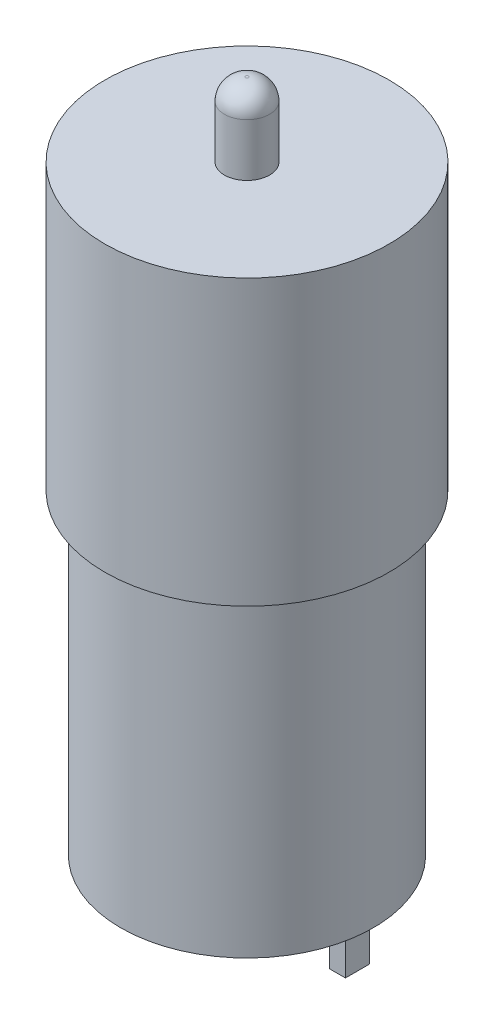
ISO-10303-21;
HEADER;
FILE_DESCRIPTION(('STEP AP214'),'2;1');
FILE_NAME('part.step','',(''),(''),'','','');
FILE_SCHEMA(('AUTOMOTIVE_DESIGN { 1 0 10303 214 1 1 1 1 }'));
ENDSEC;
DATA;
#1=APPLICATION_CONTEXT('core data for automotive mechanical design processes');
#2=APPLICATION_PROTOCOL_DEFINITION('international standard','automotive_design',2000,#1);
#3=PRODUCT_CONTEXT('',#1,'mechanical');
#4=PRODUCT('Part','Part','',(#3));
#5=PRODUCT_RELATED_PRODUCT_CATEGORY('part','',(#4));
#6=PRODUCT_DEFINITION_FORMATION('','',#4);
#7=PRODUCT_DEFINITION_CONTEXT('part definition',#1,'design');
#8=PRODUCT_DEFINITION('design','',#6,#7);
#9=PRODUCT_DEFINITION_SHAPE('','',#8);
#10=(LENGTH_UNIT() NAMED_UNIT(*) SI_UNIT(.MILLI.,.METRE.));
#11=(NAMED_UNIT(*) PLANE_ANGLE_UNIT() SI_UNIT($,.RADIAN.));
#12=(NAMED_UNIT(*) SI_UNIT($,.STERADIAN.) SOLID_ANGLE_UNIT());
#13=UNCERTAINTY_MEASURE_WITH_UNIT(LENGTH_MEASURE(1.E-05),#10,'distance_accuracy_value','');
#14=(GEOMETRIC_REPRESENTATION_CONTEXT(3) GLOBAL_UNCERTAINTY_ASSIGNED_CONTEXT((#13)) GLOBAL_UNIT_ASSIGNED_CONTEXT((#10,
#11,#12)) REPRESENTATION_CONTEXT('',''));
#15=CARTESIAN_POINT('',(0.,0.,0.));
#16=DIRECTION('',(0.,0.,1.));
#17=DIRECTION('',(1.,0.,0.));
#18=AXIS2_PLACEMENT_3D('',#15,#16,#17);
#19=CARTESIAN_POINT('',(0.,0.,0.));
#20=DIRECTION('',(0.,1.,0.));
#21=DIRECTION('',(0.,0.,1.));
#22=AXIS2_PLACEMENT_3D('',#19,#20,#21);
#23=PLANE('',#22);
#24=DIRECTION('',(0.,0.,1.));
#25=VECTOR('',#24,1.);
#26=CARTESIAN_POINT('',(10.5,0.,1.15));
#27=LINE('',#26,#25);
#28=CARTESIAN_POINT('',(10.5,0.,-1.15));
#29=VERTEX_POINT('',#28);
#30=CARTESIAN_POINT('',(10.5,0.,1.15));
#31=VERTEX_POINT('',#30);
#32=EDGE_CURVE('E121',#29,#31,#27,.T.);
#33=ORIENTED_EDGE('',*,*,#32,.F.);
#34=DIRECTION('',(1.,0.,0.));
#35=VECTOR('',#34,1.);
#36=CARTESIAN_POINT('',(9.,0.,-1.15));
#37=LINE('',#36,#35);
#38=CARTESIAN_POINT('',(9.,0.,-1.15));
#39=VERTEX_POINT('',#38);
#40=EDGE_CURVE('E134',#39,#29,#37,.T.);
#41=ORIENTED_EDGE('',*,*,#40,.F.);
#42=DIRECTION('',(0.,0.,-1.));
#43=VECTOR('',#42,1.);
#44=CARTESIAN_POINT('',(9.,0.,1.15));
#45=LINE('',#44,#43);
#46=CARTESIAN_POINT('',(9.,0.,1.15));
#47=VERTEX_POINT('',#46);
#48=EDGE_CURVE('E143',#47,#39,#45,.T.);
#49=ORIENTED_EDGE('',*,*,#48,.F.);
#50=DIRECTION('',(-1.,0.,0.));
#51=VECTOR('',#50,1.);
#52=CARTESIAN_POINT('',(9.,0.,1.15));
#53=LINE('',#52,#51);
#54=EDGE_CURVE('E124',#31,#47,#53,.T.);
#55=ORIENTED_EDGE('',*,*,#54,.F.);
#56=EDGE_LOOP('',(#33,#41,#49,#55));
#57=FACE_BOUND('',#56,.T.);
#58=CARTESIAN_POINT('',(0.,0.,0.));
#59=DIRECTION('',(0.,1.,0.));
#60=DIRECTION('',(0.,0.,1.));
#61=AXIS2_PLACEMENT_3D('',#58,#59,#60);
#62=CIRCLE('',#61,3.215);
#63=CARTESIAN_POINT('',(0.,0.,3.215));
#64=VERTEX_POINT('',#63);
#65=EDGE_CURVE('E180',#64,#64,#62,.F.);
#66=ORIENTED_EDGE('',*,*,#65,.F.);
#67=EDGE_LOOP('',(#66));
#68=FACE_BOUND('',#67,.T.);
#69=CARTESIAN_POINT('',(0.,0.,0.));
#70=DIRECTION('',(0.,1.,0.));
#71=DIRECTION('',(0.,0.,1.));
#72=AXIS2_PLACEMENT_3D('',#69,#70,#71);
#73=CIRCLE('',#72,12.);
#74=CARTESIAN_POINT('',(0.,0.,12.));
#75=VERTEX_POINT('',#74);
#76=EDGE_CURVE('E166',#75,#75,#73,.T.);
#77=ORIENTED_EDGE('',*,*,#76,.F.);
#78=EDGE_LOOP('',(#77));
#79=FACE_BOUND('',#78,.T.);
#80=DIRECTION('',(0.,0.,1.));
#81=VECTOR('',#80,1.);
#82=CARTESIAN_POINT('',(-9.,0.,1.14999999999999));
#83=LINE('',#82,#81);
#84=CARTESIAN_POINT('',(-9.,0.,-1.15000000000001));
#85=VERTEX_POINT('',#84);
#86=CARTESIAN_POINT('',(-9.,0.,1.14999999999999));
#87=VERTEX_POINT('',#86);
#88=EDGE_CURVE('E120',#85,#87,#83,.T.);
#89=ORIENTED_EDGE('',*,*,#88,.F.);
#90=DIRECTION('',(1.,0.,0.));
#91=VECTOR('',#90,1.);
#92=CARTESIAN_POINT('',(-9.,0.,-1.15000000000001));
#93=LINE('',#92,#91);
#94=CARTESIAN_POINT('',(-10.5,0.,-1.15000000000001));
#95=VERTEX_POINT('',#94);
#96=EDGE_CURVE('E117',#95,#85,#93,.T.);
#97=ORIENTED_EDGE('',*,*,#96,.F.);
#98=DIRECTION('',(0.,0.,-1.));
#99=VECTOR('',#98,1.);
#100=CARTESIAN_POINT('',(-10.5,0.,1.14999999999999));
#101=LINE('',#100,#99);
#102=CARTESIAN_POINT('',(-10.5,0.,1.14999999999999));
#103=VERTEX_POINT('',#102);
#104=EDGE_CURVE('E55',#103,#95,#101,.T.);
#105=ORIENTED_EDGE('',*,*,#104,.F.);
#106=DIRECTION('',(-1.,0.,0.));
#107=VECTOR('',#106,1.);
#108=CARTESIAN_POINT('',(-9.,0.,1.14999999999999));
#109=LINE('',#108,#107);
#110=EDGE_CURVE('E50',#87,#103,#109,.T.);
#111=ORIENTED_EDGE('',*,*,#110,.F.);
#112=EDGE_LOOP('',(#89,#97,#105,#111));
#113=FACE_BOUND('',#112,.T.);
#114=ADVANCED_FACE('F35',(#57,#68,#79,#113),#23,.F.);
#115=CARTESIAN_POINT('',(0.,30.,0.));
#116=DIRECTION('',(0.,-1.,0.));
#117=DIRECTION('',(0.,0.,-1.));
#118=AXIS2_PLACEMENT_3D('',#115,#116,#117);
#119=CYLINDRICAL_SURFACE('',#118,12.);
#120=CARTESIAN_POINT('',(0.,30.,0.));
#121=DIRECTION('',(0.,1.,0.));
#122=DIRECTION('',(0.,0.,1.));
#123=AXIS2_PLACEMENT_3D('',#120,#121,#122);
#124=CIRCLE('',#123,12.);
#125=CARTESIAN_POINT('',(0.,30.,12.));
#126=VERTEX_POINT('',#125);
#127=EDGE_CURVE('E169',#126,#126,#124,.T.);
#128=ORIENTED_EDGE('',*,*,#127,.F.);
#129=EDGE_LOOP('',(#128));
#130=FACE_BOUND('',#129,.T.);
#131=ORIENTED_EDGE('',*,*,#76,.T.);
#132=EDGE_LOOP('',(#131));
#133=FACE_BOUND('',#132,.T.);
#134=ADVANCED_FACE('F201',(#130,#133),#119,.T.);
#135=CARTESIAN_POINT('',(0.,57.,0.));
#136=DIRECTION('',(0.,-1.,0.));
#137=DIRECTION('',(0.,0.,-1.));
#138=AXIS2_PLACEMENT_3D('',#135,#136,#137);
#139=CYLINDRICAL_SURFACE('',#138,13.5);
#140=CARTESIAN_POINT('',(0.,57.,0.));
#141=DIRECTION('',(0.,1.,0.));
#142=DIRECTION('',(0.,0.,1.));
#143=AXIS2_PLACEMENT_3D('',#140,#141,#142);
#144=CIRCLE('',#143,13.5);
#145=CARTESIAN_POINT('',(0.,57.,13.5));
#146=VERTEX_POINT('',#145);
#147=EDGE_CURVE('E163',#146,#146,#144,.T.);
#148=ORIENTED_EDGE('',*,*,#147,.F.);
#149=EDGE_LOOP('',(#148));
#150=FACE_BOUND('',#149,.T.);
#151=CARTESIAN_POINT('',(0.,30.,0.));
#152=DIRECTION('',(0.,1.,0.));
#153=DIRECTION('',(0.,0.,1.));
#154=AXIS2_PLACEMENT_3D('',#151,#152,#153);
#155=CIRCLE('',#154,13.5);
#156=CARTESIAN_POINT('',(0.,30.,13.5));
#157=VERTEX_POINT('',#156);
#158=EDGE_CURVE('E162',#157,#157,#155,.T.);
#159=ORIENTED_EDGE('',*,*,#158,.T.);
#160=EDGE_LOOP('',(#159));
#161=FACE_BOUND('',#160,.T.);
#162=ADVANCED_FACE('F207',(#150,#161),#139,.T.);
#163=CARTESIAN_POINT('',(0.,57.,0.));
#164=DIRECTION('',(0.,1.,0.));
#165=DIRECTION('',(0.,0.,1.));
#166=AXIS2_PLACEMENT_3D('',#163,#164,#165);
#167=PLANE('',#166);
#168=CARTESIAN_POINT('',(0.,57.,0.));
#169=DIRECTION('',(0.,1.,0.));
#170=DIRECTION('',(0.,0.,1.));
#171=AXIS2_PLACEMENT_3D('',#168,#169,#170);
#172=CIRCLE('',#171,2.15);
#173=CARTESIAN_POINT('',(0.,57.,2.15));
#174=VERTEX_POINT('',#173);
#175=EDGE_CURVE('E159',#174,#174,#172,.T.);
#176=ORIENTED_EDGE('',*,*,#175,.F.);
#177=EDGE_LOOP('',(#176));
#178=FACE_BOUND('',#177,.T.);
#179=ORIENTED_EDGE('',*,*,#147,.T.);
#180=EDGE_LOOP('',(#179));
#181=FACE_BOUND('',#180,.T.);
#182=ADVANCED_FACE('F236',(#178,#181),#167,.T.);
#183=CARTESIAN_POINT('',(0.,30.,0.));
#184=DIRECTION('',(0.,1.,0.));
#185=DIRECTION('',(0.,0.,1.));
#186=AXIS2_PLACEMENT_3D('',#183,#184,#185);
#187=PLANE('',#186);
#188=ORIENTED_EDGE('',*,*,#127,.T.);
#189=EDGE_LOOP('',(#188));
#190=FACE_BOUND('',#189,.T.);
#191=ORIENTED_EDGE('',*,*,#158,.F.);
#192=EDGE_LOOP('',(#191));
#193=FACE_BOUND('',#192,.T.);
#194=ADVANCED_FACE('F232',(#190,#193),#187,.F.);
#195=CARTESIAN_POINT('',(0.,64.,0.));
#196=DIRECTION('',(0.,-1.,0.));
#197=DIRECTION('',(0.,0.,-1.));
#198=AXIS2_PLACEMENT_3D('',#195,#196,#197);
#199=CYLINDRICAL_SURFACE('',#198,2.15);
#200=CARTESIAN_POINT('',(0.,62.,0.));
#201=DIRECTION('',(0.,1.,0.));
#202=DIRECTION('',(0.,0.,1.));
#203=AXIS2_PLACEMENT_3D('',#200,#201,#202);
#204=CIRCLE('',#203,2.15);
#205=CARTESIAN_POINT('',(0.,62.,2.15));
#206=VERTEX_POINT('',#205);
#207=EDGE_CURVE('E177',#206,#206,#204,.F.);
#208=ORIENTED_EDGE('',*,*,#207,.T.);
#209=EDGE_LOOP('',(#208));
#210=FACE_BOUND('',#209,.T.);
#211=ORIENTED_EDGE('',*,*,#175,.T.);
#212=EDGE_LOOP('',(#211));
#213=FACE_BOUND('',#212,.T.);
#214=ADVANCED_FACE('F223',(#210,#213),#199,.T.);
#215=CARTESIAN_POINT('',(0.,64.,0.));
#216=DIRECTION('',(0.,1.,0.));
#217=DIRECTION('',(0.,0.,1.));
#218=AXIS2_PLACEMENT_3D('',#215,#216,#217);
#219=PLANE('',#218);
#220=CARTESIAN_POINT('',(0.,64.,0.));
#221=DIRECTION('',(0.,1.,0.));
#222=DIRECTION('',(0.,0.,1.));
#223=AXIS2_PLACEMENT_3D('',#220,#221,#222);
#224=CIRCLE('',#223,0.15);
#225=CARTESIAN_POINT('',(0.,64.,0.15));
#226=VERTEX_POINT('',#225);
#227=EDGE_CURVE('E172',#226,#226,#224,.T.);
#228=ORIENTED_EDGE('',*,*,#227,.T.);
#229=EDGE_LOOP('',(#228));
#230=FACE_BOUND('',#229,.T.);
#231=ADVANCED_FACE('F215',(#230),#219,.T.);
#232=CARTESIAN_POINT('',(0.,62.,0.));
#233=DIRECTION('',(0.,1.,0.));
#234=DIRECTION('',(0.,0.,1.));
#235=AXIS2_PLACEMENT_3D('',#232,#233,#234);
#236=DEGENERATE_TOROIDAL_SURFACE('',#235,0.15,2.,.T.);
#237=ORIENTED_EDGE('',*,*,#207,.F.);
#238=EDGE_LOOP('',(#237));
#239=FACE_BOUND('',#238,.T.);
#240=ORIENTED_EDGE('',*,*,#227,.F.);
#241=EDGE_LOOP('',(#240));
#242=FACE_BOUND('',#241,.T.);
#243=ADVANCED_FACE('F213',(#239,#242),#236,.T.);
#244=CARTESIAN_POINT('',(0.,-2.32,0.));
#245=DIRECTION('',(0.,1.,0.));
#246=DIRECTION('',(0.,0.,1.));
#247=AXIS2_PLACEMENT_3D('',#244,#245,#246);
#248=CYLINDRICAL_SURFACE('',#247,3.215);
#249=CARTESIAN_POINT('',(0.,-0.32,0.));
#250=DIRECTION('',(0.,-1.,0.));
#251=DIRECTION('',(0.,0.,-1.));
#252=AXIS2_PLACEMENT_3D('',#249,#250,#251);
#253=CIRCLE('',#252,3.215);
#254=CARTESIAN_POINT('',(0.,-0.32,-3.215));
#255=VERTEX_POINT('',#254);
#256=EDGE_CURVE('E11',#255,#255,#253,.F.);
#257=ORIENTED_EDGE('',*,*,#256,.T.);
#258=EDGE_LOOP('',(#257));
#259=FACE_BOUND('',#258,.T.);
#260=ORIENTED_EDGE('',*,*,#65,.T.);
#261=EDGE_LOOP('',(#260));
#262=FACE_BOUND('',#261,.T.);
#263=ADVANCED_FACE('F197',(#259,#262),#248,.T.);
#264=CARTESIAN_POINT('',(0.,-2.32,0.));
#265=DIRECTION('',(0.,-1.,0.));
#266=DIRECTION('',(0.,0.,-1.));
#267=AXIS2_PLACEMENT_3D('',#264,#265,#266);
#268=PLANE('',#267);
#269=CARTESIAN_POINT('',(0.,-2.32,0.));
#270=DIRECTION('',(0.,-1.,0.));
#271=DIRECTION('',(0.,0.,-1.));
#272=AXIS2_PLACEMENT_3D('',#269,#270,#271);
#273=CIRCLE('',#272,1.215);
#274=CARTESIAN_POINT('',(0.,-2.32,-1.215));
#275=VERTEX_POINT('',#274);
#276=EDGE_CURVE('E43',#275,#275,#273,.T.);
#277=ORIENTED_EDGE('',*,*,#276,.T.);
#278=EDGE_LOOP('',(#277));
#279=FACE_BOUND('',#278,.T.);
#280=ADVANCED_FACE('F185',(#279),#268,.T.);
#281=CARTESIAN_POINT('',(0.,-0.32,0.));
#282=DIRECTION('',(0.,-1.,0.));
#283=DIRECTION('',(0.,0.,-1.));
#284=AXIS2_PLACEMENT_3D('',#281,#282,#283);
#285=DEGENERATE_TOROIDAL_SURFACE('',#284,1.215,2.,.T.);
#286=ORIENTED_EDGE('',*,*,#256,.F.);
#287=EDGE_LOOP('',(#286));
#288=FACE_BOUND('',#287,.T.);
#289=ORIENTED_EDGE('',*,*,#276,.F.);
#290=EDGE_LOOP('',(#289));
#291=FACE_BOUND('',#290,.T.);
#292=ADVANCED_FACE('F37',(#288,#291),#285,.T.);
#293=CARTESIAN_POINT('',(10.5,-4.3,1.15));
#294=DIRECTION('',(-1.,0.,0.));
#295=DIRECTION('',(0.,0.,1.));
#296=AXIS2_PLACEMENT_3D('',#293,#294,#295);
#297=PLANE('',#296);
#298=ORIENTED_EDGE('',*,*,#32,.T.);
#299=DIRECTION('',(0.,1.,0.));
#300=VECTOR('',#299,1.);
#301=CARTESIAN_POINT('',(10.5,-4.3,1.15));
#302=LINE('',#301,#300);
#303=CARTESIAN_POINT('',(10.5,-4.3,1.15));
#304=VERTEX_POINT('',#303);
#305=EDGE_CURVE('E156',#304,#31,#302,.T.);
#306=ORIENTED_EDGE('',*,*,#305,.F.);
#307=DIRECTION('',(0.,0.,1.));
#308=VECTOR('',#307,1.);
#309=CARTESIAN_POINT('',(10.5,-4.3,1.15));
#310=LINE('',#309,#308);
#311=CARTESIAN_POINT('',(10.5,-4.3,-1.15));
#312=VERTEX_POINT('',#311);
#313=EDGE_CURVE('E130',#312,#304,#310,.T.);
#314=ORIENTED_EDGE('',*,*,#313,.F.);
#315=DIRECTION('',(0.,1.,0.));
#316=VECTOR('',#315,1.);
#317=CARTESIAN_POINT('',(10.5,-4.3,-1.15));
#318=LINE('',#317,#316);
#319=EDGE_CURVE('E139',#312,#29,#318,.T.);
#320=ORIENTED_EDGE('',*,*,#319,.T.);
#321=EDGE_LOOP('',(#298,#306,#314,#320));
#322=FACE_BOUND('',#321,.T.);
#323=ADVANCED_FACE('F188',(#322),#297,.F.);
#324=CARTESIAN_POINT('',(9.,-4.3,1.15));
#325=DIRECTION('',(0.,0.,-1.));
#326=DIRECTION('',(-1.,0.,0.));
#327=AXIS2_PLACEMENT_3D('',#324,#325,#326);
#328=PLANE('',#327);
#329=ORIENTED_EDGE('',*,*,#54,.T.);
#330=DIRECTION('',(0.,1.,0.));
#331=VECTOR('',#330,1.);
#332=CARTESIAN_POINT('',(9.,-4.3,1.15));
#333=LINE('',#332,#331);
#334=CARTESIAN_POINT('',(9.,-4.3,1.15));
#335=VERTEX_POINT('',#334);
#336=EDGE_CURVE('E153',#335,#47,#333,.T.);
#337=ORIENTED_EDGE('',*,*,#336,.F.);
#338=DIRECTION('',(-1.,0.,0.));
#339=VECTOR('',#338,1.);
#340=CARTESIAN_POINT('',(9.,-4.3,1.15));
#341=LINE('',#340,#339);
#342=EDGE_CURVE('E133',#304,#335,#341,.T.);
#343=ORIENTED_EDGE('',*,*,#342,.F.);
#344=ORIENTED_EDGE('',*,*,#305,.T.);
#345=EDGE_LOOP('',(#329,#337,#343,#344));
#346=FACE_BOUND('',#345,.T.);
#347=ADVANCED_FACE('F194',(#346),#328,.F.);
#348=CARTESIAN_POINT('',(9.,-4.3,1.15));
#349=DIRECTION('',(1.,0.,0.));
#350=DIRECTION('',(0.,0.,-1.));
#351=AXIS2_PLACEMENT_3D('',#348,#349,#350);
#352=PLANE('',#351);
#353=ORIENTED_EDGE('',*,*,#48,.T.);
#354=DIRECTION('',(0.,1.,0.));
#355=VECTOR('',#354,1.);
#356=CARTESIAN_POINT('',(9.,-4.3,-1.15));
#357=LINE('',#356,#355);
#358=CARTESIAN_POINT('',(9.,-4.3,-1.15));
#359=VERTEX_POINT('',#358);
#360=EDGE_CURVE('E150',#359,#39,#357,.T.);
#361=ORIENTED_EDGE('',*,*,#360,.F.);
#362=DIRECTION('',(0.,0.,-1.));
#363=VECTOR('',#362,1.);
#364=CARTESIAN_POINT('',(9.,-4.3,1.15));
#365=LINE('',#364,#363);
#366=EDGE_CURVE('E136',#335,#359,#365,.T.);
#367=ORIENTED_EDGE('',*,*,#366,.F.);
#368=ORIENTED_EDGE('',*,*,#336,.T.);
#369=EDGE_LOOP('',(#353,#361,#367,#368));
#370=FACE_BOUND('',#369,.T.);
#371=ADVANCED_FACE('F253',(#370),#352,.F.);
#372=CARTESIAN_POINT('',(9.,-4.3,-1.15));
#373=DIRECTION('',(0.,0.,1.));
#374=DIRECTION('',(1.,0.,0.));
#375=AXIS2_PLACEMENT_3D('',#372,#373,#374);
#376=PLANE('',#375);
#377=ORIENTED_EDGE('',*,*,#40,.T.);
#378=ORIENTED_EDGE('',*,*,#319,.F.);
#379=DIRECTION('',(1.,0.,0.));
#380=VECTOR('',#379,1.);
#381=CARTESIAN_POINT('',(9.,-4.3,-1.15));
#382=LINE('',#381,#380);
#383=EDGE_CURVE('E138',#359,#312,#382,.T.);
#384=ORIENTED_EDGE('',*,*,#383,.F.);
#385=ORIENTED_EDGE('',*,*,#360,.T.);
#386=EDGE_LOOP('',(#377,#378,#384,#385));
#387=FACE_BOUND('',#386,.T.);
#388=ADVANCED_FACE('F257',(#387),#376,.F.);
#389=CARTESIAN_POINT('',(0.,-4.3,0.));
#390=DIRECTION('',(0.,-1.,0.));
#391=DIRECTION('',(0.,0.,-1.));
#392=AXIS2_PLACEMENT_3D('',#389,#390,#391);
#393=PLANE('',#392);
#394=ORIENTED_EDGE('',*,*,#313,.T.);
#395=ORIENTED_EDGE('',*,*,#342,.T.);
#396=ORIENTED_EDGE('',*,*,#366,.T.);
#397=ORIENTED_EDGE('',*,*,#383,.T.);
#398=EDGE_LOOP('',(#394,#395,#396,#397));
#399=FACE_BOUND('',#398,.T.);
#400=ADVANCED_FACE('F261',(#399),#393,.T.);
#401=CARTESIAN_POINT('',(-9.,-4.3,1.14999999999999));
#402=DIRECTION('',(-1.,0.,0.));
#403=DIRECTION('',(0.,0.,1.));
#404=AXIS2_PLACEMENT_3D('',#401,#402,#403);
#405=PLANE('',#404);
#406=ORIENTED_EDGE('',*,*,#88,.T.);
#407=DIRECTION('',(0.,1.,0.));
#408=VECTOR('',#407,1.);
#409=CARTESIAN_POINT('',(-9.,-4.3,1.14999999999999));
#410=LINE('',#409,#408);
#411=CARTESIAN_POINT('',(-9.,-4.3,1.14999999999999));
#412=VERTEX_POINT('',#411);
#413=EDGE_CURVE('E101',#412,#87,#410,.T.);
#414=ORIENTED_EDGE('',*,*,#413,.F.);
#415=DIRECTION('',(0.,0.,1.));
#416=VECTOR('',#415,1.);
#417=CARTESIAN_POINT('',(-9.,-4.3,1.14999999999999));
#418=LINE('',#417,#416);
#419=CARTESIAN_POINT('',(-9.,-4.3,-1.15000000000001));
#420=VERTEX_POINT('',#419);
#421=EDGE_CURVE('E108',#420,#412,#418,.T.);
#422=ORIENTED_EDGE('',*,*,#421,.F.);
#423=DIRECTION('',(0.,1.,0.));
#424=VECTOR('',#423,1.);
#425=CARTESIAN_POINT('',(-9.,-4.3,-1.15000000000001));
#426=LINE('',#425,#424);
#427=EDGE_CURVE('E411',#420,#85,#426,.T.);
#428=ORIENTED_EDGE('',*,*,#427,.T.);
#429=EDGE_LOOP('',(#406,#414,#422,#428));
#430=FACE_BOUND('',#429,.T.);
#431=ADVANCED_FACE('F119',(#430),#405,.F.);
#432=CARTESIAN_POINT('',(-9.,-4.3,1.14999999999999));
#433=DIRECTION('',(0.,0.,-1.));
#434=DIRECTION('',(-1.,0.,0.));
#435=AXIS2_PLACEMENT_3D('',#432,#433,#434);
#436=PLANE('',#435);
#437=ORIENTED_EDGE('',*,*,#110,.T.);
#438=DIRECTION('',(0.,1.,0.));
#439=VECTOR('',#438,1.);
#440=CARTESIAN_POINT('',(-10.5,-4.3,1.14999999999999));
#441=LINE('',#440,#439);
#442=CARTESIAN_POINT('',(-10.5,-4.3,1.14999999999999));
#443=VERTEX_POINT('',#442);
#444=EDGE_CURVE('E104',#443,#103,#441,.T.);
#445=ORIENTED_EDGE('',*,*,#444,.F.);
#446=DIRECTION('',(-1.,0.,0.));
#447=VECTOR('',#446,1.);
#448=CARTESIAN_POINT('',(-9.,-4.3,1.14999999999999));
#449=LINE('',#448,#447);
#450=EDGE_CURVE('E97',#412,#443,#449,.T.);
#451=ORIENTED_EDGE('',*,*,#450,.F.);
#452=ORIENTED_EDGE('',*,*,#413,.T.);
#453=EDGE_LOOP('',(#437,#445,#451,#452));
#454=FACE_BOUND('',#453,.T.);
#455=ADVANCED_FACE('F99',(#454),#436,.F.);
#456=CARTESIAN_POINT('',(-10.5,-4.3,1.14999999999999));
#457=DIRECTION('',(1.,0.,0.));
#458=DIRECTION('',(0.,0.,-1.));
#459=AXIS2_PLACEMENT_3D('',#456,#457,#458);
#460=PLANE('',#459);
#461=ORIENTED_EDGE('',*,*,#104,.T.);
#462=DIRECTION('',(0.,1.,0.));
#463=VECTOR('',#462,1.);
#464=CARTESIAN_POINT('',(-10.5,-4.3,-1.15000000000001));
#465=LINE('',#464,#463);
#466=CARTESIAN_POINT('',(-10.5,-4.3,-1.15000000000001));
#467=VERTEX_POINT('',#466);
#468=EDGE_CURVE('E126',#467,#95,#465,.T.);
#469=ORIENTED_EDGE('',*,*,#468,.F.);
#470=DIRECTION('',(0.,0.,-1.));
#471=VECTOR('',#470,1.);
#472=CARTESIAN_POINT('',(-10.5,-4.3,1.14999999999999));
#473=LINE('',#472,#471);
#474=EDGE_CURVE('E107',#443,#467,#473,.T.);
#475=ORIENTED_EDGE('',*,*,#474,.F.);
#476=ORIENTED_EDGE('',*,*,#444,.T.);
#477=EDGE_LOOP('',(#461,#469,#475,#476));
#478=FACE_BOUND('',#477,.T.);
#479=ADVANCED_FACE('F270',(#478),#460,.F.);
#480=CARTESIAN_POINT('',(-9.,-4.3,-1.15000000000001));
#481=DIRECTION('',(0.,0.,1.));
#482=DIRECTION('',(1.,0.,0.));
#483=AXIS2_PLACEMENT_3D('',#480,#481,#482);
#484=PLANE('',#483);
#485=ORIENTED_EDGE('',*,*,#96,.T.);
#486=ORIENTED_EDGE('',*,*,#427,.F.);
#487=DIRECTION('',(1.,0.,0.));
#488=VECTOR('',#487,1.);
#489=CARTESIAN_POINT('',(-9.,-4.3,-1.15000000000001));
#490=LINE('',#489,#488);
#491=EDGE_CURVE('E113',#467,#420,#490,.T.);
#492=ORIENTED_EDGE('',*,*,#491,.F.);
#493=ORIENTED_EDGE('',*,*,#468,.T.);
#494=EDGE_LOOP('',(#485,#486,#492,#493));
#495=FACE_BOUND('',#494,.T.);
#496=ADVANCED_FACE('F273',(#495),#484,.F.);
#497=CARTESIAN_POINT('',(0.,-4.3,0.));
#498=DIRECTION('',(0.,1.,0.));
#499=DIRECTION('',(0.,0.,1.));
#500=AXIS2_PLACEMENT_3D('',#497,#498,#499);
#501=PLANE('',#500);
#502=ORIENTED_EDGE('',*,*,#421,.T.);
#503=ORIENTED_EDGE('',*,*,#450,.T.);
#504=ORIENTED_EDGE('',*,*,#474,.T.);
#505=ORIENTED_EDGE('',*,*,#491,.T.);
#506=EDGE_LOOP('',(#502,#503,#504,#505));
#507=FACE_BOUND('',#506,.T.);
#508=ADVANCED_FACE('F111',(#507),#501,.F.);
#509=CLOSED_SHELL('',(#114,#134,#162,#182,#194,#214,#231,#243,#263,#280,#292,#323,#347,#371,
#388,#400,#431,#455,#479,#496,#508));
#510=MANIFOLD_SOLID_BREP('B2',#509);
#511=ADVANCED_BREP_SHAPE_REPRESENTATION('',(#18,#510),#14);
#512=SHAPE_DEFINITION_REPRESENTATION(#9,#511);
ENDSEC;
END-ISO-10303-21;
